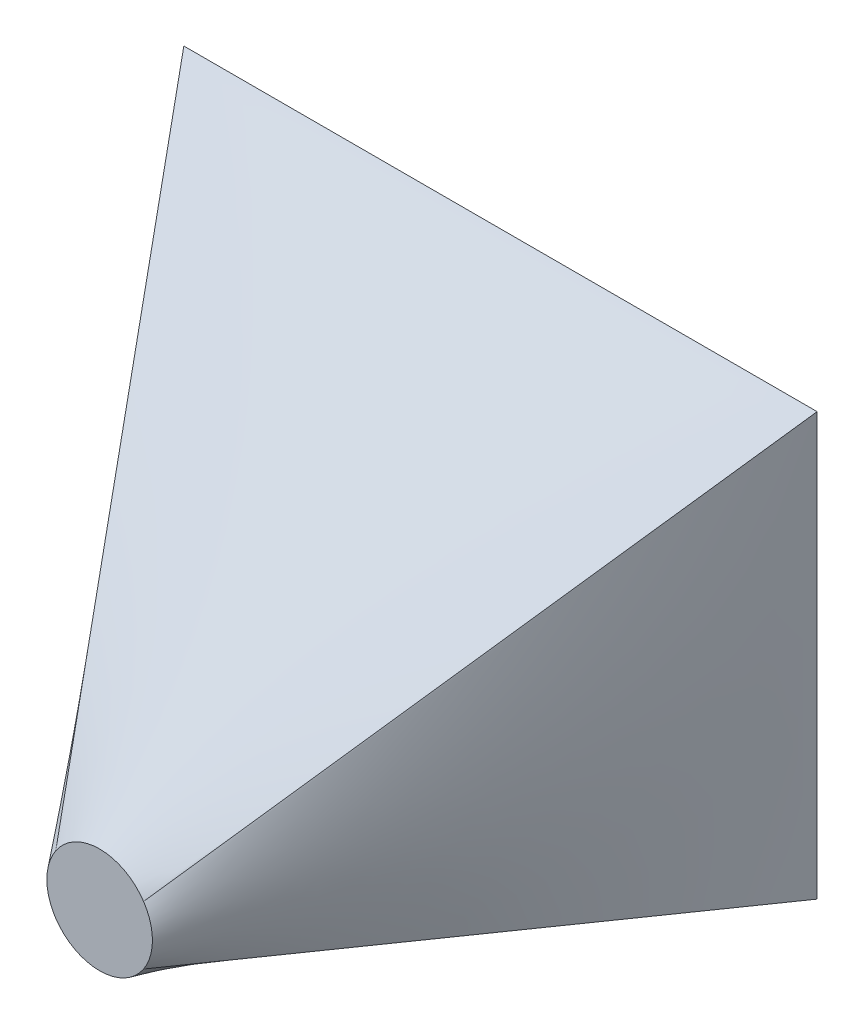
ISO-10303-21;
HEADER;
FILE_DESCRIPTION(('STEP AP214'),'2;1');
FILE_NAME('part.step','',(''),(''),'','','');
FILE_SCHEMA(('AUTOMOTIVE_DESIGN { 1 0 10303 214 1 1 1 1 }'));
ENDSEC;
DATA;
#1=APPLICATION_CONTEXT('core data for automotive mechanical design processes');
#2=APPLICATION_PROTOCOL_DEFINITION('international standard','automotive_design',2000,#1);
#3=PRODUCT_CONTEXT('',#1,'mechanical');
#4=PRODUCT('Part','Part','',(#3));
#5=PRODUCT_RELATED_PRODUCT_CATEGORY('part','',(#4));
#6=PRODUCT_DEFINITION_FORMATION('','',#4);
#7=PRODUCT_DEFINITION_CONTEXT('part definition',#1,'design');
#8=PRODUCT_DEFINITION('design','',#6,#7);
#9=PRODUCT_DEFINITION_SHAPE('','',#8);
#10=(LENGTH_UNIT() NAMED_UNIT(*) SI_UNIT(.MILLI.,.METRE.));
#11=(NAMED_UNIT(*) PLANE_ANGLE_UNIT() SI_UNIT($,.RADIAN.));
#12=(NAMED_UNIT(*) SI_UNIT($,.STERADIAN.) SOLID_ANGLE_UNIT());
#13=UNCERTAINTY_MEASURE_WITH_UNIT(LENGTH_MEASURE(1.E-05),#10,'distance_accuracy_value','');
#14=(GEOMETRIC_REPRESENTATION_CONTEXT(3) GLOBAL_UNCERTAINTY_ASSIGNED_CONTEXT((#13)) GLOBAL_UNIT_ASSIGNED_CONTEXT((#10,
#11,#12)) REPRESENTATION_CONTEXT('',''));
#15=CARTESIAN_POINT('',(0.,0.,0.));
#16=DIRECTION('',(0.,0.,1.));
#17=DIRECTION('',(1.,0.,0.));
#18=AXIS2_PLACEMENT_3D('',#15,#16,#17);
#19=CARTESIAN_POINT('',(0.,0.,46.5));
#20=DIRECTION('',(0.,0.,-1.));
#21=DIRECTION('',(-1.,0.,0.));
#22=AXIS2_PLACEMENT_3D('',#19,#20,#21);
#23=PLANE('',#22);
#24=DIRECTION('',(1.,0.,0.));
#25=VECTOR('',#24,1.);
#26=CARTESIAN_POINT('',(-10.3923365000263,-41.0937651662509,46.5));
#27=LINE('',#26,#25);
#28=CARTESIAN_POINT('',(-10.3923365000263,-41.0937651662509,46.5));
#29=VERTEX_POINT('',#28);
#30=CARTESIAN_POINT('',(17.1076634999738,-41.0937651662509,46.5));
#31=VERTEX_POINT('',#30);
#32=EDGE_CURVE('E95',#29,#31,#27,.T.);
#33=ORIENTED_EDGE('',*,*,#32,.T.);
#34=DIRECTION('',(0.,-1.,0.));
#35=VECTOR('',#34,1.);
#36=CARTESIAN_POINT('',(17.1076634999738,-23.0937651662511,46.5));
#37=LINE('',#36,#35);
#38=CARTESIAN_POINT('',(17.1076634999738,-23.0937651662511,46.5));
#39=VERTEX_POINT('',#38);
#40=EDGE_CURVE('E278',#39,#31,#37,.T.);
#41=ORIENTED_EDGE('',*,*,#40,.F.);
#42=DIRECTION('',(1.,0.,0.));
#43=VECTOR('',#42,1.);
#44=CARTESIAN_POINT('',(-10.3923365000263,-23.0937651662511,46.5));
#45=LINE('',#44,#43);
#46=CARTESIAN_POINT('',(-10.3923365000263,-23.0937651662511,46.5));
#47=VERTEX_POINT('',#46);
#48=EDGE_CURVE('E192',#47,#39,#45,.T.);
#49=ORIENTED_EDGE('',*,*,#48,.F.);
#50=DIRECTION('',(0.,-1.,0.));
#51=VECTOR('',#50,1.);
#52=CARTESIAN_POINT('',(-10.3923365000263,-23.0937651662511,46.5));
#53=LINE('',#52,#51);
#54=EDGE_CURVE('E187',#47,#29,#53,.T.);
#55=ORIENTED_EDGE('',*,*,#54,.T.);
#56=EDGE_LOOP('',(#33,#41,#49,#55));
#57=FACE_BOUND('',#56,.T.);
#58=DIRECTION('',(1.,0.,0.));
#59=VECTOR('',#58,1.);
#60=CARTESIAN_POINT('',(-11.6423365000262,-22.0937651662509,46.5));
#61=LINE('',#60,#59);
#62=CARTESIAN_POINT('',(-11.6423365000262,-22.0937651662509,46.5));
#63=VERTEX_POINT('',#62);
#64=CARTESIAN_POINT('',(18.3576634999738,-22.0937651662509,46.5));
#65=VERTEX_POINT('',#64);
#66=EDGE_CURVE('E474',#63,#65,#61,.T.);
#67=ORIENTED_EDGE('',*,*,#66,.T.);
#68=DIRECTION('',(0.,-1.,0.));
#69=VECTOR('',#68,1.);
#70=CARTESIAN_POINT('',(18.3576634999738,-22.0937651662509,46.5));
#71=LINE('',#70,#69);
#72=CARTESIAN_POINT('',(18.3576634999738,-42.0937651662509,46.5));
#73=VERTEX_POINT('',#72);
#74=EDGE_CURVE('E471',#65,#73,#71,.T.);
#75=ORIENTED_EDGE('',*,*,#74,.T.);
#76=DIRECTION('',(1.,0.,0.));
#77=VECTOR('',#76,1.);
#78=CARTESIAN_POINT('',(-11.6423365000262,-42.0937651662509,46.5));
#79=LINE('',#78,#77);
#80=CARTESIAN_POINT('',(-11.6423365000262,-42.0937651662509,46.5));
#81=VERTEX_POINT('',#80);
#82=EDGE_CURVE('E101',#81,#73,#79,.T.);
#83=ORIENTED_EDGE('',*,*,#82,.F.);
#84=DIRECTION('',(0.,-1.,0.));
#85=VECTOR('',#84,1.);
#86=CARTESIAN_POINT('',(-11.6423365000262,-22.0937651662509,46.5));
#87=LINE('',#86,#85);
#88=EDGE_CURVE('E12',#63,#81,#87,.T.);
#89=ORIENTED_EDGE('',*,*,#88,.F.);
#90=EDGE_LOOP('',(#67,#75,#83,#89));
#91=FACE_BOUND('',#90,.T.);
#92=ADVANCED_FACE('F91',(#57,#91),#23,.T.);
#93=CARTESIAN_POINT('',(3.62027439024388,-40.2790097684514,65.75));
#94=DIRECTION('',(0.,0.,-1.));
#95=DIRECTION('',(0.,1.,0.));
#96=AXIS2_PLACEMENT_3D('',#93,#94,#95);
#97=PLANE('',#96);
#98=CARTESIAN_POINT('',(3.62027439024388,-40.2790097684514,65.75));
#99=DIRECTION('',(0.,0.,-1.));
#100=DIRECTION('',(0.,1.,0.));
#101=AXIS2_PLACEMENT_3D('',#98,#99,#100);
#102=CIRCLE('',#101,2.5);
#103=CARTESIAN_POINT('',(1.54014865439927,-38.8922592778883,65.75));
#104=VERTEX_POINT('',#103);
#105=CARTESIAN_POINT('',(5.70040012608849,-38.8922592778883,65.75));
#106=VERTEX_POINT('',#105);
#107=EDGE_CURVE('E390',#104,#106,#102,.T.);
#108=ORIENTED_EDGE('',*,*,#107,.F.);
#109=CARTESIAN_POINT('',(1.54014865439927,-41.6657602590145,65.75));
#110=VERTEX_POINT('',#109);
#111=EDGE_CURVE('E378',#110,#104,#102,.T.);
#112=ORIENTED_EDGE('',*,*,#111,.F.);
#113=CARTESIAN_POINT('',(5.70040012608849,-41.6657602590145,65.75));
#114=VERTEX_POINT('',#113);
#115=EDGE_CURVE('E369',#114,#110,#102,.T.);
#116=ORIENTED_EDGE('',*,*,#115,.F.);
#117=EDGE_CURVE('E377',#106,#114,#102,.T.);
#118=ORIENTED_EDGE('',*,*,#117,.F.);
#119=EDGE_LOOP('',(#108,#112,#116,#118));
#120=FACE_BOUND('',#119,.T.);
#121=ADVANCED_FACE('F333',(#120),#97,.F.);
#122=CARTESIAN_POINT('',(5.70040012608849,-41.6657602590145,65.75));
#123=CARTESIAN_POINT('',(18.3576634999738,-42.0937651662509,46.5));
#124=CARTESIAN_POINT('',(5.60424627993464,-41.8099910282452,65.75));
#125=CARTESIAN_POINT('',(17.1076634999738,-42.0937651662509,46.5));
#126=CARTESIAN_POINT('',(5.48749163146452,-41.9524444156819,65.75));
#127=CARTESIAN_POINT('',(15.8576634999738,-42.0937651662509,46.5));
#128=CARTESIAN_POINT('',(5.20998254682573,-42.2180073758146,65.75));
#129=CARTESIAN_POINT('',(13.3576634999738,-42.0937651662509,46.5));
#130=CARTESIAN_POINT('',(5.04911329449083,-42.3409801720672,65.75));
#131=CARTESIAN_POINT('',(12.1076634999738,-42.0937651662509,46.5));
#132=CARTESIAN_POINT('',(4.68854753665159,-42.5488324585181,65.75));
#133=CARTESIAN_POINT('',(9.60766349997379,-42.0937651662509,46.5));
#134=CARTESIAN_POINT('',(4.48885519438361,-42.6334862990303,65.75));
#135=CARTESIAN_POINT('',(8.35766349997379,-42.0937651662509,46.5));
#136=CARTESIAN_POINT('',(4.06612291825204,-42.7486679303111,65.75));
#137=CARTESIAN_POINT('',(5.8576634999738,-42.0937651662509,46.5));
#138=CARTESIAN_POINT('',(3.84326762294721,-42.7790097684514,65.75));
#139=CARTESIAN_POINT('',(4.6076634999738,-42.0937651662509,46.5));
#140=CARTESIAN_POINT('',(3.39728115754055,-42.7790097684514,65.75));
#141=CARTESIAN_POINT('',(2.1076634999738,-42.0937651662509,46.5));
#142=CARTESIAN_POINT('',(3.17442586223571,-42.7486679303111,65.75));
#143=CARTESIAN_POINT('',(0.857663499973796,-42.0937651662509,46.5));
#144=CARTESIAN_POINT('',(2.75169358610415,-42.6334862990303,65.75));
#145=CARTESIAN_POINT('',(-1.6423365000262,-42.0937651662509,46.5));
#146=CARTESIAN_POINT('',(2.55200124383617,-42.5488324585181,65.75));
#147=CARTESIAN_POINT('',(-2.89233650002621,-42.0937651662509,46.5));
#148=CARTESIAN_POINT('',(2.19143548599693,-42.3409801720673,65.75));
#149=CARTESIAN_POINT('',(-5.39233650002621,-42.0937651662509,46.5));
#150=CARTESIAN_POINT('',(2.03056623366203,-42.2180073758146,65.75));
#151=CARTESIAN_POINT('',(-6.64233650002621,-42.0937651662509,46.5));
#152=CARTESIAN_POINT('',(1.75305714902324,-41.9524444156818,65.75));
#153=CARTESIAN_POINT('',(-9.14233650002621,-42.0937651662509,46.5));
#154=CARTESIAN_POINT('',(1.63630250055311,-41.8099910282453,65.75));
#155=CARTESIAN_POINT('',(-10.3923365000262,-42.0937651662509,46.5));
#156=CARTESIAN_POINT('',(1.54014865439927,-41.6657602590145,65.75));
#157=CARTESIAN_POINT('',(-11.6423365000262,-42.0937651662509,46.5));
#158=B_SPLINE_SURFACE_WITH_KNOTS('',3,1,((#122,#123),(#124,#125),(#126,#127),(#128,#129),(#130,
#131),(#132,#133),(#134,#135),(#136,#137),(#138,#139),(#140,#141),(#142,#143),(#144,#145),(#146,
#147),(#148,#149),(#150,#151),(#152,#153),(#154,#155),(#156,#157)),.UNSPECIFIED.,.F.,.F.,.F.,(4,
2,2,2,2,2,2,2,4),(2,2),(0.,0.125,0.25,0.375,0.5,0.625,0.75,0.875,1.),(0.,1.),.UNSPECIFIED.);
#159=DIRECTION('',(-0.564922582974008,-0.0183417341183471,-0.824940031781406));
#160=VECTOR('',#159,1.);
#161=CARTESIAN_POINT('',(-5.05109392281348,-41.8797627126327,56.125));
#162=LINE('',#161,#160);
#163=EDGE_CURVE('E401',#110,#81,#162,.T.);
#164=DIRECTION('',(-0.549303270476,0.0185746703991161,0.835416601860374));
#165=VECTOR('',#164,1.);
#166=CARTESIAN_POINT('',(12.0290318130311,-41.8797627126327,56.125));
#167=LINE('',#166,#165);
#168=EDGE_CURVE('E397',#73,#114,#167,.T.);
#169=ORIENTED_EDGE('',*,*,#115,.T.);
#170=ORIENTED_EDGE('',*,*,#163,.T.);
#171=ORIENTED_EDGE('',*,*,#82,.T.);
#172=ORIENTED_EDGE('',*,*,#168,.T.);
#173=EDGE_LOOP('',(#169,#170,#171,#172));
#174=FACE_BOUND('',#173,.T.);
#175=ADVANCED_FACE('F343',(#174),#158,.T.);
#176=CARTESIAN_POINT('',(1.54014865439927,-41.6657602590145,65.75));
#177=CARTESIAN_POINT('',(-11.6423365000262,-42.0937651662509,46.5));
#178=CARTESIAN_POINT('',(1.41194352619414,-41.4734525667068,65.75));
#179=CARTESIAN_POINT('',(-11.6423365000262,-40.4270984995842,46.5));
#180=CARTESIAN_POINT('',(1.30530774595337,-41.2545970769524,65.75));
#181=CARTESIAN_POINT('',(-11.6423365000262,-38.7604318329176,46.5));
#182=CARTESIAN_POINT('',(1.1592889603075,-40.7833825218062,65.75));
#183=CARTESIAN_POINT('',(-11.6423365000262,-35.4270984995843,46.5));
#184=CARTESIAN_POINT('',(1.12027439024388,-40.5313227998947,65.75));
#185=CARTESIAN_POINT('',(-11.6423365000262,-33.7604318329176,46.5));
#186=CARTESIAN_POINT('',(1.12027439024388,-40.0266967370081,65.75));
#187=CARTESIAN_POINT('',(-11.6423365000262,-30.4270984995843,46.5));
#188=CARTESIAN_POINT('',(1.1592889603075,-39.7746370150966,65.75));
#189=CARTESIAN_POINT('',(-11.6423365000262,-28.7604318329176,46.5));
#190=CARTESIAN_POINT('',(1.30530774595337,-39.3034224599504,65.75));
#191=CARTESIAN_POINT('',(-11.6423365000262,-25.4270984995842,46.5));
#192=CARTESIAN_POINT('',(1.41194352619414,-39.084566970196,65.75));
#193=CARTESIAN_POINT('',(-11.6423365000262,-23.7604318329176,46.5));
#194=CARTESIAN_POINT('',(1.54014865439927,-38.8922592778883,65.75));
#195=CARTESIAN_POINT('',(-11.6423365000262,-22.0937651662509,46.5));
#196=B_SPLINE_SURFACE_WITH_KNOTS('',3,1,((#176,#177),(#178,#179),(#180,#181),(#182,#183),(#184,
#185),(#186,#187),(#188,#189),(#190,#191),(#192,#193),(#194,#195)),.UNSPECIFIED.,.F.,.F.,.F.,(4,
2,2,2,4),(2,2),(0.,0.25,0.5,0.75,1.),(0.,1.),.UNSPECIFIED.);
#197=DIRECTION('',(-0.458530287567025,0.584306998678186,-0.669578454461754));
#198=VECTOR('',#197,1.);
#199=CARTESIAN_POINT('',(-5.05109392281348,-30.4930122220696,56.125));
#200=LINE('',#199,#198);
#201=EDGE_CURVE('E404',#104,#63,#200,.T.);
#202=ORIENTED_EDGE('',*,*,#111,.T.);
#203=ORIENTED_EDGE('',*,*,#201,.T.);
#204=ORIENTED_EDGE('',*,*,#88,.T.);
#205=ORIENTED_EDGE('',*,*,#163,.F.);
#206=EDGE_LOOP('',(#202,#203,#204,#205));
#207=FACE_BOUND('',#206,.T.);
#208=ADVANCED_FACE('F437',(#207),#196,.T.);
#209=CARTESIAN_POINT('',(5.70040012608849,-38.8922592778883,65.75));
#210=CARTESIAN_POINT('',(18.3576634999738,-22.0937651662509,46.5));
#211=CARTESIAN_POINT('',(5.82860525429362,-39.084566970196,65.75));
#212=CARTESIAN_POINT('',(18.3576634999738,-23.7604318329175,46.5));
#213=CARTESIAN_POINT('',(5.93524103453439,-39.3034224599505,65.75));
#214=CARTESIAN_POINT('',(18.3576634999738,-25.4270984995842,46.5));
#215=CARTESIAN_POINT('',(6.08125982018025,-39.7746370150966,65.75));
#216=CARTESIAN_POINT('',(18.3576634999738,-28.7604318329175,46.5));
#217=CARTESIAN_POINT('',(6.12027439024388,-40.0266967370081,65.75));
#218=CARTESIAN_POINT('',(18.3576634999738,-30.4270984995842,46.5));
#219=CARTESIAN_POINT('',(6.12027439024388,-40.5313227998947,65.75));
#220=CARTESIAN_POINT('',(18.3576634999738,-33.7604318329175,46.5));
#221=CARTESIAN_POINT('',(6.08125982018025,-40.7833825218062,65.75));
#222=CARTESIAN_POINT('',(18.3576634999738,-35.4270984995842,46.5));
#223=CARTESIAN_POINT('',(5.93524103453439,-41.2545970769524,65.75));
#224=CARTESIAN_POINT('',(18.3576634999738,-38.7604318329175,46.5));
#225=CARTESIAN_POINT('',(5.82860525429362,-41.4734525667068,65.75));
#226=CARTESIAN_POINT('',(18.3576634999738,-40.4270984995842,46.5));
#227=CARTESIAN_POINT('',(5.70040012608849,-41.6657602590145,65.75));
#228=CARTESIAN_POINT('',(18.3576634999738,-42.0937651662509,46.5));
#229=B_SPLINE_SURFACE_WITH_KNOTS('',3,1,((#209,#210),(#211,#212),(#213,#214),(#215,#216),(#217,
#218),(#219,#220),(#221,#222),(#223,#224),(#225,#226),(#227,#228)),.UNSPECIFIED.,.F.,.F.,.F.,(4,
2,2,2,4),(2,2),(0.,0.25,0.5,0.75,1.),(0.,1.),.UNSPECIFIED.);
#230=DIRECTION('',(0.443921013749372,0.589164048753762,-0.675144323243412));
#231=VECTOR('',#230,1.);
#232=CARTESIAN_POINT('',(12.0290318130311,-30.4930122220696,56.125));
#233=LINE('',#232,#231);
#234=EDGE_CURVE('E472',#106,#65,#233,.T.);
#235=ORIENTED_EDGE('',*,*,#117,.T.);
#236=ORIENTED_EDGE('',*,*,#168,.F.);
#237=ORIENTED_EDGE('',*,*,#74,.F.);
#238=ORIENTED_EDGE('',*,*,#234,.F.);
#239=EDGE_LOOP('',(#235,#236,#237,#238));
#240=FACE_BOUND('',#239,.T.);
#241=ADVANCED_FACE('F427',(#240),#229,.T.);
#242=CARTESIAN_POINT('',(1.54014865439927,-38.8922592778883,65.75));
#243=CARTESIAN_POINT('',(-11.6423365000262,-22.0937651662509,46.5));
#244=CARTESIAN_POINT('',(1.63630250055311,-38.7480285086576,65.75));
#245=CARTESIAN_POINT('',(-10.3923365000262,-22.0937651662509,46.5));
#246=CARTESIAN_POINT('',(1.75305714902324,-38.605575121221,65.75));
#247=CARTESIAN_POINT('',(-9.14233650002622,-22.0937651662509,46.5));
#248=CARTESIAN_POINT('',(2.03056623366203,-38.3400121610883,65.75));
#249=CARTESIAN_POINT('',(-6.64233650002622,-22.0937651662509,46.5));
#250=CARTESIAN_POINT('',(2.19143548599693,-38.2170393648356,65.75));
#251=CARTESIAN_POINT('',(-5.39233650002622,-22.0937651662509,46.5));
#252=CARTESIAN_POINT('',(2.55200124383617,-38.0091870783847,65.75));
#253=CARTESIAN_POINT('',(-2.89233650002622,-22.0937651662509,46.5));
#254=CARTESIAN_POINT('',(2.75169358610415,-37.9245332378725,65.75));
#255=CARTESIAN_POINT('',(-1.64233650002622,-22.0937651662509,46.5));
#256=CARTESIAN_POINT('',(3.17442586223571,-37.8093516065918,65.75));
#257=CARTESIAN_POINT('',(0.857663499973782,-22.0937651662509,46.5));
#258=CARTESIAN_POINT('',(3.39728115754055,-37.7790097684514,65.75));
#259=CARTESIAN_POINT('',(2.10766349997378,-22.0937651662509,46.5));
#260=CARTESIAN_POINT('',(3.84326762294721,-37.7790097684514,65.75));
#261=CARTESIAN_POINT('',(4.60766349997378,-22.0937651662509,46.5));
#262=CARTESIAN_POINT('',(4.06612291825204,-37.8093516065918,65.75));
#263=CARTESIAN_POINT('',(5.85766349997378,-22.0937651662509,46.5));
#264=CARTESIAN_POINT('',(4.48885519438361,-37.9245332378725,65.75));
#265=CARTESIAN_POINT('',(8.35766349997378,-22.0937651662509,46.5));
#266=CARTESIAN_POINT('',(4.68854753665159,-38.0091870783847,65.75));
#267=CARTESIAN_POINT('',(9.60766349997378,-22.0937651662509,46.5));
#268=CARTESIAN_POINT('',(5.04911329449083,-38.2170393648356,65.75));
#269=CARTESIAN_POINT('',(12.1076634999738,-22.0937651662509,46.5));
#270=CARTESIAN_POINT('',(5.20998254682573,-38.3400121610883,65.75));
#271=CARTESIAN_POINT('',(13.3576634999738,-22.0937651662509,46.5));
#272=CARTESIAN_POINT('',(5.48749163146452,-38.605575121221,65.75));
#273=CARTESIAN_POINT('',(15.8576634999738,-22.0937651662509,46.5));
#274=CARTESIAN_POINT('',(5.60424627993464,-38.7480285086576,65.75));
#275=CARTESIAN_POINT('',(17.1076634999738,-22.0937651662509,46.5));
#276=CARTESIAN_POINT('',(5.70040012608849,-38.8922592778883,65.75));
#277=CARTESIAN_POINT('',(18.3576634999738,-22.0937651662509,46.5));
#278=B_SPLINE_SURFACE_WITH_KNOTS('',3,1,((#242,#243),(#244,#245),(#246,#247),(#248,#249),(#250,
#251),(#252,#253),(#254,#255),(#256,#257),(#258,#259),(#260,#261),(#262,#263),(#264,#265),(#266,
#267),(#268,#269),(#270,#271),(#272,#273),(#274,#275),(#276,#277)),.UNSPECIFIED.,.F.,.F.,.F.,(4,
2,2,2,2,2,2,2,4),(2,2),(0.,0.125,0.25,0.375,0.5,0.625,0.75,0.875,1.),(0.,1.),.UNSPECIFIED.);
#279=ORIENTED_EDGE('',*,*,#107,.T.);
#280=ORIENTED_EDGE('',*,*,#234,.T.);
#281=ORIENTED_EDGE('',*,*,#66,.F.);
#282=ORIENTED_EDGE('',*,*,#201,.F.);
#283=EDGE_LOOP('',(#279,#280,#281,#282));
#284=FACE_BOUND('',#283,.T.);
#285=ADVANCED_FACE('F252',(#284),#278,.T.);
#286=CARTESIAN_POINT('',(3.62027439024389,-38.6765722168606,59.7696216415071));
#287=DIRECTION('',(0.,0.258819045102523,-0.965925826289068));
#288=DIRECTION('',(0.,0.965925826289068,0.258819045102523));
#289=AXIS2_PLACEMENT_3D('',#286,#287,#288);
#290=PLANE('',#289);
#291=CARTESIAN_POINT('',(3.62027439024389,-38.6765722168606,59.7696216415071));
#292=DIRECTION('',(0.,0.258819045102523,-0.965925826289068));
#293=DIRECTION('',(0.,0.965925826289068,0.258819045102523));
#294=AXIS2_PLACEMENT_3D('',#291,#292,#293);
#295=CIRCLE('',#294,2.5);
#296=CARTESIAN_POINT('',(1.50718528374478,-37.386110341272,60.1153998589343));
#297=VERTEX_POINT('',#296);
#298=CARTESIAN_POINT('',(5.733363496743,-37.386110341272,60.1153998589343));
#299=VERTEX_POINT('',#298);
#300=EDGE_CURVE('E159',#297,#299,#295,.T.);
#301=ORIENTED_EDGE('',*,*,#300,.T.);
#302=CARTESIAN_POINT('',(5.733363496743,-39.9670340924493,59.42384342408));
#303=VERTEX_POINT('',#302);
#304=EDGE_CURVE('E168',#299,#303,#295,.T.);
#305=ORIENTED_EDGE('',*,*,#304,.T.);
#306=CARTESIAN_POINT('',(1.50718528374478,-39.9670340924493,59.42384342408));
#307=VERTEX_POINT('',#306);
#308=EDGE_CURVE('E177',#303,#307,#295,.T.);
#309=ORIENTED_EDGE('',*,*,#308,.T.);
#310=EDGE_CURVE('E173',#307,#297,#295,.T.);
#311=ORIENTED_EDGE('',*,*,#310,.T.);
#312=EDGE_LOOP('',(#301,#305,#309,#311));
#313=FACE_BOUND('',#312,.T.);
#314=ADVANCED_FACE('F175',(#313),#290,.T.);
#315=CARTESIAN_POINT('',(5.733363496743,-39.9670340924493,59.42384342408));
#316=CARTESIAN_POINT('',(17.1076634999738,-41.0937651662509,46.5));
#317=CARTESIAN_POINT('',(5.63926169108176,-40.1108007399873,59.3853212669737));
#318=CARTESIAN_POINT('',(15.9618301666404,-41.0937651662509,46.5));
#319=CARTESIAN_POINT('',(5.52369971610793,-40.2535512043542,59.3470713953274));
#320=CARTESIAN_POINT('',(14.8159968333071,-41.0937651662509,46.5));
#321=CARTESIAN_POINT('',(5.24592378921782,-40.5208844510366,59.2754396677688));
#322=CARTESIAN_POINT('',(12.5243301666404,-41.0937651662509,46.5));
#323=CARTESIAN_POINT('',(5.08357165201196,-40.6453260407506,59.2420956443002));
#324=CARTESIAN_POINT('',(11.3784968333071,-41.0937651662509,46.5));
#325=CARTESIAN_POINT('',(4.71706324569751,-40.8563499540344,59.1855519571521));
#326=CARTESIAN_POINT('',(9.08683016664044,-41.0937651662509,46.5));
#327=CARTESIAN_POINT('',(4.5129007975529,-40.9426838070378,59.1624188709603));
#328=CARTESIAN_POINT('',(7.9409968333071,-41.0937651662509,46.5));
#329=CARTESIAN_POINT('',(4.07916508675893,-41.0603077169015,59.1309016393018));
#330=CARTESIAN_POINT('',(5.64933016664043,-41.0937651662509,46.5));
#331=CARTESIAN_POINT('',(3.84979925088821,-41.0913867825833,59.1225740287508));
#332=CARTESIAN_POINT('',(4.5034968333071,-41.0937651662509,46.5));
#333=CARTESIAN_POINT('',(3.39074952959957,-41.0913867825833,59.1225740287508));
#334=CARTESIAN_POINT('',(2.21183016664042,-41.0937651662509,46.5));
#335=CARTESIAN_POINT('',(3.16138369372885,-41.0603077169015,59.1309016393018));
#336=CARTESIAN_POINT('',(1.06599683330709,-41.0937651662509,46.5));
#337=CARTESIAN_POINT('',(2.72764798293488,-40.9426838070378,59.1624188709604));
#338=CARTESIAN_POINT('',(-1.22566983335959,-41.0937651662509,46.5));
#339=CARTESIAN_POINT('',(2.52348553479026,-40.8563499540344,59.1855519571521));
#340=CARTESIAN_POINT('',(-2.37150316669292,-41.0937651662509,46.5));
#341=CARTESIAN_POINT('',(2.15697712847582,-40.6453260407506,59.2420956443001));
#342=CARTESIAN_POINT('',(-4.6631698333596,-41.0937651662509,46.5));
#343=CARTESIAN_POINT('',(1.99462499126995,-40.5208844510367,59.2754396677688));
#344=CARTESIAN_POINT('',(-5.80900316669294,-41.0937651662509,46.5));
#345=CARTESIAN_POINT('',(1.71684906437984,-40.2535512043542,59.3470713953273));
#346=CARTESIAN_POINT('',(-8.10066983335961,-41.0937651662509,46.5));
#347=CARTESIAN_POINT('',(1.60128708940602,-40.1108007399873,59.3853212669737));
#348=CARTESIAN_POINT('',(-9.24650316669295,-41.0937651662509,46.5));
#349=CARTESIAN_POINT('',(1.50718528374478,-39.9670340924493,59.42384342408));
#350=CARTESIAN_POINT('',(-10.3923365000263,-41.0937651662509,46.5));
#351=B_SPLINE_SURFACE_WITH_KNOTS('',3,1,((#315,#316),(#317,#318),(#319,#320),(#321,#322),(#323,
#324),(#325,#326),(#327,#328),(#329,#330),(#331,#332),(#333,#334),(#335,#336),(#337,#338),(#339,
#340),(#341,#342),(#343,#344),(#345,#346),(#347,#348),(#349,#350)),.UNSPECIFIED.,.F.,.F.,.F.,(4,
2,2,2,2,2,2,2,4),(2,2),(0.,0.125,0.25,0.375,0.5,0.625,0.75,0.875,1.),(0.,1.),.UNSPECIFIED.);
#352=DIRECTION('',(-0.659260688781024,0.0653059532080609,0.749073078346536));
#353=VECTOR('',#352,1.);
#354=CARTESIAN_POINT('',(11.4205134983584,-40.5303996293501,52.96192171204));
#355=LINE('',#354,#353);
#356=EDGE_CURVE('E167',#31,#303,#355,.T.);
#357=DIRECTION('',(-0.67596314094301,-0.0640049818374856,-0.73415066191242));
#358=VECTOR('',#357,1.);
#359=CARTESIAN_POINT('',(-4.44257560814075,-40.5303996293501,52.96192171204));
#360=LINE('',#359,#358);
#361=EDGE_CURVE('E190',#307,#29,#360,.T.);
#362=ORIENTED_EDGE('',*,*,#308,.F.);
#363=ORIENTED_EDGE('',*,*,#356,.F.);
#364=ORIENTED_EDGE('',*,*,#32,.F.);
#365=ORIENTED_EDGE('',*,*,#361,.F.);
#366=EDGE_LOOP('',(#362,#363,#364,#365));
#367=FACE_BOUND('',#366,.T.);
#368=ADVANCED_FACE('F219',(#367),#351,.F.);
#369=CARTESIAN_POINT('',(1.50718528374478,-39.9670340924493,59.42384342408));
#370=CARTESIAN_POINT('',(-10.3923365000263,-41.0937651662509,46.5));
#371=CARTESIAN_POINT('',(1.38819498854513,-39.785243363672,59.4725541030473));
#372=CARTESIAN_POINT('',(-10.3923365000263,-39.5937651662509,46.5));
#373=CARTESIAN_POINT('',(1.29001401731988,-39.58050720378,59.5274129917518));
#374=CARTESIAN_POINT('',(-10.3923365000263,-38.0937651662509,46.5));
#375=CARTESIAN_POINT('',(1.15590946640833,-39.1426075729525,59.644747844198));
#376=CARTESIAN_POINT('',(-10.3923365000263,-35.093765166251,46.5));
#377=CARTESIAN_POINT('',(1.12027439024389,-38.9096882203666,59.7071583966249));
#378=CARTESIAN_POINT('',(-10.3923365000263,-33.593765166251,46.5));
#379=CARTESIAN_POINT('',(1.12027439024389,-38.4434562133547,59.8320848863893));
#380=CARTESIAN_POINT('',(-10.3923365000263,-30.593765166251,46.5));
#381=CARTESIAN_POINT('',(1.15590946640833,-38.2105368607687,59.8944954388163));
#382=CARTESIAN_POINT('',(-10.3923365000263,-29.093765166251,46.5));
#383=CARTESIAN_POINT('',(1.29001401731988,-37.7726372299413,60.0118302912624));
#384=CARTESIAN_POINT('',(-10.3923365000263,-26.093765166251,46.5));
#385=CARTESIAN_POINT('',(1.38819498854512,-37.5679010700493,60.0666891799669));
#386=CARTESIAN_POINT('',(-10.3923365000263,-24.5937651662511,46.5));
#387=CARTESIAN_POINT('',(1.50718528374478,-37.386110341272,60.1153998589343));
#388=CARTESIAN_POINT('',(-10.3923365000263,-23.0937651662511,46.5));
#389=B_SPLINE_SURFACE_WITH_KNOTS('',3,1,((#369,#370),(#371,#372),(#373,#374),(#375,#376),(#377,
#378),(#379,#380),(#381,#382),(#383,#384),(#385,#386),(#387,#388)),.UNSPECIFIED.,.F.,.F.,.F.,(4,
2,2,2,4),(2,2),(0.,0.25,0.5,0.75,1.),(0.,1.),.UNSPECIFIED.);
#390=DIRECTION('',(-0.516274294342713,0.620089660224818,-0.590719617317051));
#391=VECTOR('',#390,1.);
#392=CARTESIAN_POINT('',(-4.44257560814076,-30.2399377537615,53.3076999294671));
#393=LINE('',#392,#391);
#394=EDGE_CURVE('E109',#297,#47,#393,.T.);
#395=ORIENTED_EDGE('',*,*,#310,.F.);
#396=ORIENTED_EDGE('',*,*,#361,.T.);
#397=ORIENTED_EDGE('',*,*,#54,.F.);
#398=ORIENTED_EDGE('',*,*,#394,.F.);
#399=EDGE_LOOP('',(#395,#396,#397,#398));
#400=FACE_BOUND('',#399,.T.);
#401=ADVANCED_FACE('F185',(#400),#389,.F.);
#402=CARTESIAN_POINT('',(5.733363496743,-37.386110341272,60.1153998589343));
#403=CARTESIAN_POINT('',(17.1076634999738,-23.0937651662511,46.5));
#404=CARTESIAN_POINT('',(5.85235379194265,-37.5679010700493,60.0666891799669));
#405=CARTESIAN_POINT('',(17.1076634999738,-24.5937651662511,46.5));
#406=CARTESIAN_POINT('',(5.9505347631679,-37.7726372299413,60.0118302912624));
#407=CARTESIAN_POINT('',(17.1076634999738,-26.093765166251,46.5));
#408=CARTESIAN_POINT('',(6.08463931407945,-38.2105368607687,59.8944954388163));
#409=CARTESIAN_POINT('',(17.1076634999738,-29.093765166251,46.5));
#410=CARTESIAN_POINT('',(6.12027439024389,-38.4434562133547,59.8320848863893));
#411=CARTESIAN_POINT('',(17.1076634999738,-30.593765166251,46.5));
#412=CARTESIAN_POINT('',(6.12027439024389,-38.9096882203666,59.7071583966249));
#413=CARTESIAN_POINT('',(17.1076634999738,-33.593765166251,46.5));
#414=CARTESIAN_POINT('',(6.08463931407945,-39.1426075729525,59.644747844198));
#415=CARTESIAN_POINT('',(17.1076634999738,-35.093765166251,46.5));
#416=CARTESIAN_POINT('',(5.9505347631679,-39.58050720378,59.5274129917518));
#417=CARTESIAN_POINT('',(17.1076634999738,-38.0937651662509,46.5));
#418=CARTESIAN_POINT('',(5.85235379194265,-39.785243363672,59.4725541030473));
#419=CARTESIAN_POINT('',(17.1076634999738,-39.5937651662509,46.5));
#420=CARTESIAN_POINT('',(5.733363496743,-39.9670340924493,59.42384342408));
#421=CARTESIAN_POINT('',(17.1076634999738,-41.0937651662509,46.5));
#422=B_SPLINE_SURFACE_WITH_KNOTS('',3,1,((#402,#403),(#404,#405),(#406,#407),(#408,#409),(#410,
#411),(#412,#413),(#414,#415),(#416,#417),(#418,#419),(#420,#421)),.UNSPECIFIED.,.F.,.F.,.F.,(4,
2,2,2,4),(2,2),(0.,0.25,0.5,0.75,1.),(0.,1.),.UNSPECIFIED.);
#423=DIRECTION('',(0.499264358213001,0.627349246910902,-0.597635359578467));
#424=VECTOR('',#423,1.);
#425=CARTESIAN_POINT('',(11.4205134983584,-30.2399377537615,53.3076999294671));
#426=LINE('',#425,#424);
#427=EDGE_CURVE('E163',#299,#39,#426,.T.);
#428=ORIENTED_EDGE('',*,*,#304,.F.);
#429=ORIENTED_EDGE('',*,*,#427,.T.);
#430=ORIENTED_EDGE('',*,*,#40,.T.);
#431=ORIENTED_EDGE('',*,*,#356,.T.);
#432=EDGE_LOOP('',(#428,#429,#430,#431));
#433=FACE_BOUND('',#432,.T.);
#434=ADVANCED_FACE('F218',(#433),#422,.F.);
#435=CARTESIAN_POINT('',(1.50718528374478,-37.386110341272,60.1153998589343));
#436=CARTESIAN_POINT('',(-10.3923365000263,-23.0937651662511,46.5));
#437=CARTESIAN_POINT('',(1.60128708940601,-37.242343693734,60.1539220160406));
#438=CARTESIAN_POINT('',(-9.24650316669295,-23.0937651662511,46.5));
#439=CARTESIAN_POINT('',(1.71684906437984,-37.099593229367,60.1921718876869));
#440=CARTESIAN_POINT('',(-8.10066983335961,-23.0937651662511,46.5));
#441=CARTESIAN_POINT('',(1.99462499126995,-36.8322599826846,60.2638036152454));
#442=CARTESIAN_POINT('',(-5.80900316669294,-23.0937651662511,46.5));
#443=CARTESIAN_POINT('',(2.15697712847582,-36.7078183929707,60.2971476387141));
#444=CARTESIAN_POINT('',(-4.66316983335961,-23.0937651662511,46.5));
#445=CARTESIAN_POINT('',(2.52348553479026,-36.4967944796869,60.3536913258622));
#446=CARTESIAN_POINT('',(-2.37150316669293,-23.0937651662511,46.5));
#447=CARTESIAN_POINT('',(2.72764798293488,-36.4104606266835,60.3768244120539));
#448=CARTESIAN_POINT('',(-1.2256698333596,-23.0937651662511,46.5));
#449=CARTESIAN_POINT('',(3.16138369372884,-36.2928367168198,60.4083416437125));
#450=CARTESIAN_POINT('',(1.06599683330708,-23.0937651662511,46.5));
#451=CARTESIAN_POINT('',(3.39074952959957,-36.261757651138,60.4166692542634));
#452=CARTESIAN_POINT('',(2.21183016664041,-23.0937651662511,46.5));
#453=CARTESIAN_POINT('',(3.84979925088821,-36.261757651138,60.4166692542634));
#454=CARTESIAN_POINT('',(4.50349683330709,-23.0937651662511,46.5));
#455=CARTESIAN_POINT('',(4.07916508675893,-36.2928367168198,60.4083416437125));
#456=CARTESIAN_POINT('',(5.64933016664042,-23.0937651662511,46.5));
#457=CARTESIAN_POINT('',(4.5129007975529,-36.4104606266835,60.3768244120539));
#458=CARTESIAN_POINT('',(7.94099683330709,-23.0937651662511,46.5));
#459=CARTESIAN_POINT('',(4.71706324569751,-36.4967944796869,60.3536913258622));
#460=CARTESIAN_POINT('',(9.08683016664043,-23.0937651662511,46.5));
#461=CARTESIAN_POINT('',(5.08357165201196,-36.7078183929707,60.2971476387141));
#462=CARTESIAN_POINT('',(11.3784968333071,-23.0937651662511,46.5));
#463=CARTESIAN_POINT('',(5.24592378921782,-36.8322599826846,60.2638036152454));
#464=CARTESIAN_POINT('',(12.5243301666404,-23.0937651662511,46.5));
#465=CARTESIAN_POINT('',(5.52369971610793,-37.099593229367,60.1921718876869));
#466=CARTESIAN_POINT('',(14.8159968333071,-23.0937651662511,46.5));
#467=CARTESIAN_POINT('',(5.63926169108176,-37.242343693734,60.1539220160406));
#468=CARTESIAN_POINT('',(15.9618301666404,-23.0937651662511,46.5));
#469=CARTESIAN_POINT('',(5.733363496743,-37.386110341272,60.1153998589343));
#470=CARTESIAN_POINT('',(17.1076634999738,-23.0937651662511,46.5));
#471=B_SPLINE_SURFACE_WITH_KNOTS('',3,1,((#435,#436),(#437,#438),(#439,#440),(#441,#442),(#443,
#444),(#445,#446),(#447,#448),(#449,#450),(#451,#452),(#453,#454),(#455,#456),(#457,#458),(#459,
#460),(#461,#462),(#463,#464),(#465,#466),(#467,#468),(#469,#470)),.UNSPECIFIED.,.F.,.F.,.F.,(4,
2,2,2,2,2,2,2,4),(2,2),(0.,0.125,0.25,0.375,0.5,0.625,0.75,0.875,1.),(0.,1.),.UNSPECIFIED.);
#472=ORIENTED_EDGE('',*,*,#300,.F.);
#473=ORIENTED_EDGE('',*,*,#394,.T.);
#474=ORIENTED_EDGE('',*,*,#48,.T.);
#475=ORIENTED_EDGE('',*,*,#427,.F.);
#476=EDGE_LOOP('',(#472,#473,#474,#475));
#477=FACE_BOUND('',#476,.T.);
#478=ADVANCED_FACE('F162',(#477),#471,.F.);
#479=CLOSED_SHELL('',(#92,#121,#175,#208,#241,#285,#314,#368,#401,#434,#478));
#480=MANIFOLD_SOLID_BREP('B2',#479);
#481=ADVANCED_BREP_SHAPE_REPRESENTATION('',(#18,#480),#14);
#482=SHAPE_DEFINITION_REPRESENTATION(#9,#481);
ENDSEC;
END-ISO-10303-21;
